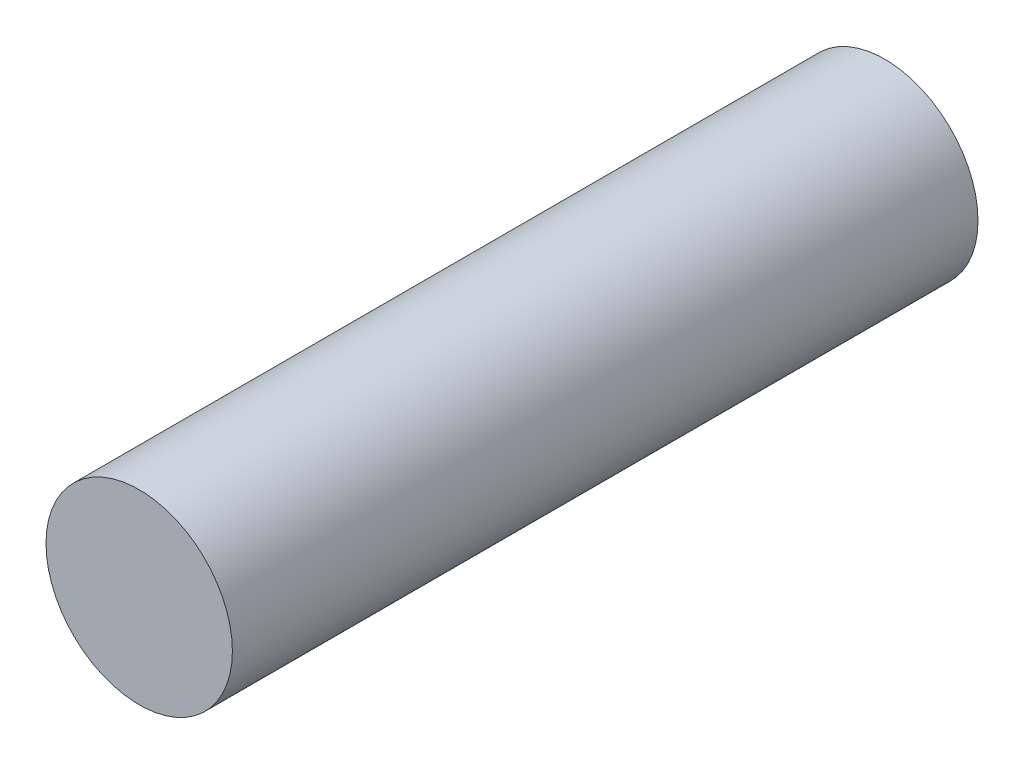
ISO-10303-21;
HEADER;
FILE_DESCRIPTION(('STEP AP214'),'2;1');
FILE_NAME('part.step','',(''),(''),'','','');
FILE_SCHEMA(('AUTOMOTIVE_DESIGN { 1 0 10303 214 1 1 1 1 }'));
ENDSEC;
DATA;
#1=APPLICATION_CONTEXT('core data for automotive mechanical design processes');
#2=APPLICATION_PROTOCOL_DEFINITION('international standard','automotive_design',2000,#1);
#3=PRODUCT_CONTEXT('',#1,'mechanical');
#4=PRODUCT('Part','Part','',(#3));
#5=PRODUCT_RELATED_PRODUCT_CATEGORY('part','',(#4));
#6=PRODUCT_DEFINITION_FORMATION('','',#4);
#7=PRODUCT_DEFINITION_CONTEXT('part definition',#1,'design');
#8=PRODUCT_DEFINITION('design','',#6,#7);
#9=PRODUCT_DEFINITION_SHAPE('','',#8);
#10=(LENGTH_UNIT() NAMED_UNIT(*) SI_UNIT(.MILLI.,.METRE.));
#11=(NAMED_UNIT(*) PLANE_ANGLE_UNIT() SI_UNIT($,.RADIAN.));
#12=(NAMED_UNIT(*) SI_UNIT($,.STERADIAN.) SOLID_ANGLE_UNIT());
#13=UNCERTAINTY_MEASURE_WITH_UNIT(LENGTH_MEASURE(1.E-05),#10,'distance_accuracy_value','');
#14=(GEOMETRIC_REPRESENTATION_CONTEXT(3) GLOBAL_UNCERTAINTY_ASSIGNED_CONTEXT((#13)) GLOBAL_UNIT_ASSIGNED_CONTEXT((#10,
#11,#12)) REPRESENTATION_CONTEXT('',''));
#15=CARTESIAN_POINT('',(0.,0.,0.));
#16=DIRECTION('',(0.,0.,1.));
#17=DIRECTION('',(1.,0.,0.));
#18=AXIS2_PLACEMENT_3D('',#15,#16,#17);
#19=CARTESIAN_POINT('',(0.,0.,15.875));
#20=DIRECTION('',(0.,0.,-1.));
#21=DIRECTION('',(-1.,0.,0.));
#22=AXIS2_PLACEMENT_3D('',#19,#20,#21);
#23=CYLINDRICAL_SURFACE('',#22,3.96875);
#24=CARTESIAN_POINT('',(0.,0.,15.875));
#25=DIRECTION('',(0.,0.,1.));
#26=DIRECTION('',(1.,0.,0.));
#27=AXIS2_PLACEMENT_3D('',#24,#25,#26);
#28=CIRCLE('',#27,3.96875);
#29=CARTESIAN_POINT('',(3.96875,0.,15.875));
#30=VERTEX_POINT('',#29);
#31=EDGE_CURVE('E10',#30,#30,#28,.T.);
#32=ORIENTED_EDGE('',*,*,#31,.F.);
#33=EDGE_LOOP('',(#32));
#34=FACE_BOUND('',#33,.T.);
#35=CARTESIAN_POINT('',(0.,0.,-15.875));
#36=DIRECTION('',(0.,0.,1.));
#37=DIRECTION('',(1.,0.,0.));
#38=AXIS2_PLACEMENT_3D('',#35,#36,#37);
#39=CIRCLE('',#38,3.96875);
#40=CARTESIAN_POINT('',(3.96875,0.,-15.875));
#41=VERTEX_POINT('',#40);
#42=EDGE_CURVE('E34',#41,#41,#39,.T.);
#43=ORIENTED_EDGE('',*,*,#42,.T.);
#44=EDGE_LOOP('',(#43));
#45=FACE_BOUND('',#44,.T.);
#46=ADVANCED_FACE('F31',(#34,#45),#23,.T.);
#47=CARTESIAN_POINT('',(0.,0.,15.875));
#48=DIRECTION('',(0.,0.,1.));
#49=DIRECTION('',(1.,0.,0.));
#50=AXIS2_PLACEMENT_3D('',#47,#48,#49);
#51=PLANE('',#50);
#52=ORIENTED_EDGE('',*,*,#31,.T.);
#53=EDGE_LOOP('',(#52));
#54=FACE_BOUND('',#53,.T.);
#55=ADVANCED_FACE('F46',(#54),#51,.T.);
#56=CARTESIAN_POINT('',(0.,0.,-15.875));
#57=DIRECTION('',(0.,0.,1.));
#58=DIRECTION('',(1.,0.,0.));
#59=AXIS2_PLACEMENT_3D('',#56,#57,#58);
#60=PLANE('',#59);
#61=ORIENTED_EDGE('',*,*,#42,.F.);
#62=EDGE_LOOP('',(#61));
#63=FACE_BOUND('',#62,.T.);
#64=ADVANCED_FACE('F44',(#63),#60,.F.);
#65=CLOSED_SHELL('',(#46,#55,#64));
#66=MANIFOLD_SOLID_BREP('B2',#65);
#67=ADVANCED_BREP_SHAPE_REPRESENTATION('',(#18,#66),#14);
#68=SHAPE_DEFINITION_REPRESENTATION(#9,#67);
ENDSEC;
END-ISO-10303-21;
